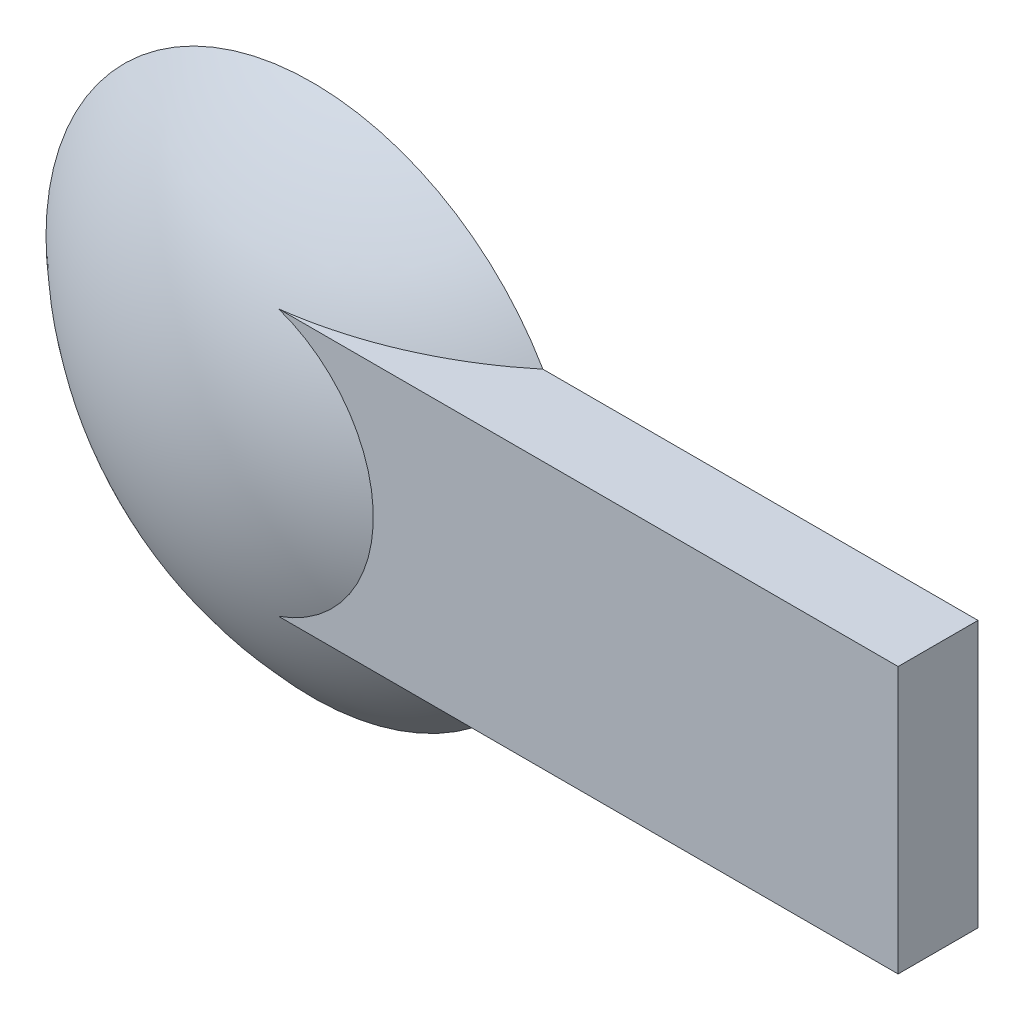
ISO-10303-21;
HEADER;
FILE_DESCRIPTION(('STEP AP214'),'2;1');
FILE_NAME('part.step','',(''),(''),'','','');
FILE_SCHEMA(('AUTOMOTIVE_DESIGN { 1 0 10303 214 1 1 1 1 }'));
ENDSEC;
DATA;
#1=APPLICATION_CONTEXT('core data for automotive mechanical design processes');
#2=APPLICATION_PROTOCOL_DEFINITION('international standard','automotive_design',2000,#1);
#3=PRODUCT_CONTEXT('',#1,'mechanical');
#4=PRODUCT('Part','Part','',(#3));
#5=PRODUCT_RELATED_PRODUCT_CATEGORY('part','',(#4));
#6=PRODUCT_DEFINITION_FORMATION('','',#4);
#7=PRODUCT_DEFINITION_CONTEXT('part definition',#1,'design');
#8=PRODUCT_DEFINITION('design','',#6,#7);
#9=PRODUCT_DEFINITION_SHAPE('','',#8);
#10=(LENGTH_UNIT() NAMED_UNIT(*) SI_UNIT(.MILLI.,.METRE.));
#11=(NAMED_UNIT(*) PLANE_ANGLE_UNIT() SI_UNIT($,.RADIAN.));
#12=(NAMED_UNIT(*) SI_UNIT($,.STERADIAN.) SOLID_ANGLE_UNIT());
#13=UNCERTAINTY_MEASURE_WITH_UNIT(LENGTH_MEASURE(1.E-05),#10,'distance_accuracy_value','');
#14=(GEOMETRIC_REPRESENTATION_CONTEXT(3) GLOBAL_UNCERTAINTY_ASSIGNED_CONTEXT((#13)) GLOBAL_UNIT_ASSIGNED_CONTEXT((#10,
#11,#12)) REPRESENTATION_CONTEXT('',''));
#15=CARTESIAN_POINT('',(0.,0.,0.));
#16=DIRECTION('',(0.,0.,1.));
#17=DIRECTION('',(1.,0.,0.));
#18=AXIS2_PLACEMENT_3D('',#15,#16,#17);
#19=CARTESIAN_POINT('',(0.,0.,-10.5));
#20=DIRECTION('',(0.,0.,-1.));
#21=DIRECTION('',(-1.,0.,0.));
#22=AXIS2_PLACEMENT_3D('',#19,#20,#21);
#23=SPHERICAL_SURFACE('',#22,14.5);
#24=CARTESIAN_POINT('',(0.,0.,3.));
#25=DIRECTION('',(0.,0.,-1.));
#26=DIRECTION('',(0.,1.,0.));
#27=AXIS2_PLACEMENT_3D('',#24,#25,#26);
#28=CIRCLE('',#27,5.29150262212918);
#29=CARTESIAN_POINT('',(1.73205080756889,5.,3.));
#30=VERTEX_POINT('',#29);
#31=CARTESIAN_POINT('',(1.73205080756889,-5.,3.));
#32=VERTEX_POINT('',#31);
#33=EDGE_CURVE('E80',#30,#32,#28,.T.);
#34=ORIENTED_EDGE('',*,*,#33,.F.);
#35=CARTESIAN_POINT('',(0.,5.,-10.5));
#36=DIRECTION('',(0.,-1.,0.));
#37=DIRECTION('',(0.,0.,-1.));
#38=AXIS2_PLACEMENT_3D('',#35,#36,#37);
#39=CIRCLE('',#38,13.6106575888162);
#40=CARTESIAN_POINT('',(8.66025403784439,5.,0.));
#41=VERTEX_POINT('',#40);
#42=EDGE_CURVE('E73',#41,#30,#39,.T.);
#43=ORIENTED_EDGE('',*,*,#42,.F.);
#44=CARTESIAN_POINT('',(0.,0.,0.));
#45=DIRECTION('',(0.,0.,-1.));
#46=DIRECTION('',(-1.,0.,0.));
#47=AXIS2_PLACEMENT_3D('',#44,#45,#46);
#48=CIRCLE('',#47,10.);
#49=CARTESIAN_POINT('',(8.66025403784439,-5.,0.));
#50=VERTEX_POINT('',#49);
#51=EDGE_CURVE('E11',#50,#41,#48,.T.);
#52=ORIENTED_EDGE('',*,*,#51,.F.);
#53=CARTESIAN_POINT('',(0.,-5.,-10.5));
#54=DIRECTION('',(0.,1.,0.));
#55=DIRECTION('',(0.,0.,1.));
#56=AXIS2_PLACEMENT_3D('',#53,#54,#55);
#57=CIRCLE('',#56,13.6106575888162);
#58=EDGE_CURVE('E79',#32,#50,#57,.T.);
#59=ORIENTED_EDGE('',*,*,#58,.F.);
#60=EDGE_LOOP('',(#34,#43,#52,#59));
#61=FACE_BOUND('',#60,.T.);
#62=ADVANCED_FACE('F33',(#61),#23,.T.);
#63=CARTESIAN_POINT('',(0.,0.,0.));
#64=DIRECTION('',(0.,0.,-1.));
#65=DIRECTION('',(-1.,0.,0.));
#66=AXIS2_PLACEMENT_3D('',#63,#64,#65);
#67=PLANE('',#66);
#68=ORIENTED_EDGE('',*,*,#51,.T.);
#69=DIRECTION('',(1.,0.,0.));
#70=VECTOR('',#69,1.);
#71=CARTESIAN_POINT('',(-500000.,5.,0.));
#72=LINE('',#71,#70);
#73=CARTESIAN_POINT('',(25.,5.,0.));
#74=VERTEX_POINT('',#73);
#75=EDGE_CURVE('E75',#41,#74,#72,.T.);
#76=ORIENTED_EDGE('',*,*,#75,.T.);
#77=DIRECTION('',(0.,-1.,0.));
#78=VECTOR('',#77,1.);
#79=CARTESIAN_POINT('',(25.,5.,0.));
#80=LINE('',#79,#78);
#81=CARTESIAN_POINT('',(25.,-5.,0.));
#82=VERTEX_POINT('',#81);
#83=EDGE_CURVE('E101',#74,#82,#80,.T.);
#84=ORIENTED_EDGE('',*,*,#83,.T.);
#85=DIRECTION('',(1.,0.,0.));
#86=VECTOR('',#85,1.);
#87=CARTESIAN_POINT('',(-500000.,-5.,0.));
#88=LINE('',#87,#86);
#89=EDGE_CURVE('E94',#50,#82,#88,.T.);
#90=ORIENTED_EDGE('',*,*,#89,.F.);
#91=EDGE_LOOP('',(#68,#76,#84,#90));
#92=FACE_BOUND('',#91,.T.);
#93=ADVANCED_FACE('F35',(#92),#67,.T.);
#94=CARTESIAN_POINT('',(-500000.,5.,3.));
#95=DIRECTION('',(0.,-1.,0.));
#96=DIRECTION('',(0.,0.,-1.));
#97=AXIS2_PLACEMENT_3D('',#94,#95,#96);
#98=PLANE('',#97);
#99=ORIENTED_EDGE('',*,*,#75,.F.);
#100=ORIENTED_EDGE('',*,*,#42,.T.);
#101=DIRECTION('',(1.,0.,0.));
#102=VECTOR('',#101,1.);
#103=CARTESIAN_POINT('',(-500000.,5.,3.));
#104=LINE('',#103,#102);
#105=CARTESIAN_POINT('',(25.,5.,3.));
#106=VERTEX_POINT('',#105);
#107=EDGE_CURVE('E56',#30,#106,#104,.T.);
#108=ORIENTED_EDGE('',*,*,#107,.T.);
#109=DIRECTION('',(0.,0.,-1.));
#110=VECTOR('',#109,1.);
#111=CARTESIAN_POINT('',(25.,5.,3.));
#112=LINE('',#111,#110);
#113=EDGE_CURVE('E90',#106,#74,#112,.T.);
#114=ORIENTED_EDGE('',*,*,#113,.T.);
#115=EDGE_LOOP('',(#99,#100,#108,#114));
#116=FACE_BOUND('',#115,.T.);
#117=ADVANCED_FACE('F74',(#116),#98,.F.);
#118=CARTESIAN_POINT('',(25.,-5.,3.));
#119=DIRECTION('',(1.,0.,0.));
#120=DIRECTION('',(0.,0.,-1.));
#121=AXIS2_PLACEMENT_3D('',#118,#119,#120);
#122=PLANE('',#121);
#123=DIRECTION('',(0.,1.,0.));
#124=VECTOR('',#123,1.);
#125=CARTESIAN_POINT('',(25.,5.,3.));
#126=LINE('',#125,#124);
#127=CARTESIAN_POINT('',(25.,-5.,3.));
#128=VERTEX_POINT('',#127);
#129=EDGE_CURVE('E41',#128,#106,#126,.T.);
#130=ORIENTED_EDGE('',*,*,#129,.F.);
#131=DIRECTION('',(0.,0.,1.));
#132=VECTOR('',#131,1.);
#133=CARTESIAN_POINT('',(25.,-5.,3.));
#134=LINE('',#133,#132);
#135=EDGE_CURVE('E104',#82,#128,#134,.T.);
#136=ORIENTED_EDGE('',*,*,#135,.F.);
#137=ORIENTED_EDGE('',*,*,#83,.F.);
#138=ORIENTED_EDGE('',*,*,#113,.F.);
#139=EDGE_LOOP('',(#130,#136,#137,#138));
#140=FACE_BOUND('',#139,.T.);
#141=ADVANCED_FACE('F105',(#140),#122,.T.);
#142=CARTESIAN_POINT('',(-500000.,5.,3.));
#143=DIRECTION('',(0.,0.,-1.));
#144=DIRECTION('',(0.,1.,0.));
#145=AXIS2_PLACEMENT_3D('',#142,#143,#144);
#146=PLANE('',#145);
#147=ORIENTED_EDGE('',*,*,#107,.F.);
#148=ORIENTED_EDGE('',*,*,#33,.T.);
#149=DIRECTION('',(1.,0.,0.));
#150=VECTOR('',#149,1.);
#151=CARTESIAN_POINT('',(-500000.,-5.,3.));
#152=LINE('',#151,#150);
#153=EDGE_CURVE('E48',#32,#128,#152,.T.);
#154=ORIENTED_EDGE('',*,*,#153,.T.);
#155=ORIENTED_EDGE('',*,*,#129,.T.);
#156=EDGE_LOOP('',(#147,#148,#154,#155));
#157=FACE_BOUND('',#156,.T.);
#158=ADVANCED_FACE('F84',(#157),#146,.F.);
#159=CARTESIAN_POINT('',(-500000.,-5.,3.));
#160=DIRECTION('',(0.,1.,0.));
#161=DIRECTION('',(0.,0.,1.));
#162=AXIS2_PLACEMENT_3D('',#159,#160,#161);
#163=PLANE('',#162);
#164=ORIENTED_EDGE('',*,*,#153,.F.);
#165=ORIENTED_EDGE('',*,*,#58,.T.);
#166=ORIENTED_EDGE('',*,*,#89,.T.);
#167=ORIENTED_EDGE('',*,*,#135,.T.);
#168=EDGE_LOOP('',(#164,#165,#166,#167));
#169=FACE_BOUND('',#168,.T.);
#170=ADVANCED_FACE('F97',(#169),#163,.F.);
#171=CLOSED_SHELL('',(#62,#93,#117,#141,#158,#170));
#172=MANIFOLD_SOLID_BREP('B2',#171);
#173=ADVANCED_BREP_SHAPE_REPRESENTATION('',(#18,#172),#14);
#174=SHAPE_DEFINITION_REPRESENTATION(#9,#173);
ENDSEC;
END-ISO-10303-21;
